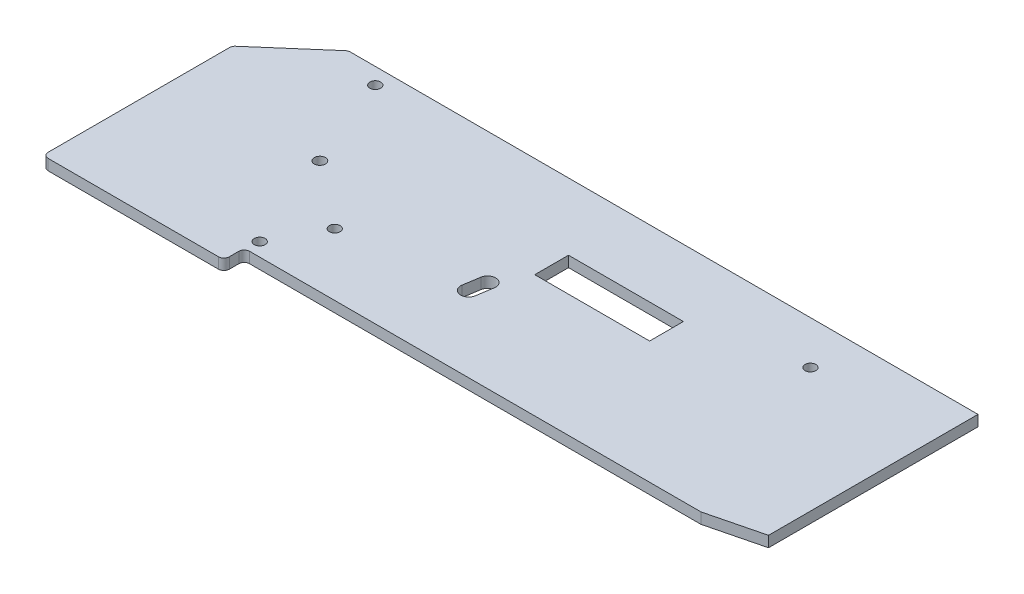
ISO-10303-21;
HEADER;
FILE_DESCRIPTION(('STEP AP214'),'2;1');
FILE_NAME('part.step','',(''),(''),'','','');
FILE_SCHEMA(('AUTOMOTIVE_DESIGN { 1 0 10303 214 1 1 1 1 }'));
ENDSEC;
DATA;
#1=APPLICATION_CONTEXT('core data for automotive mechanical design processes');
#2=APPLICATION_PROTOCOL_DEFINITION('international standard','automotive_design',2000,#1);
#3=PRODUCT_CONTEXT('',#1,'mechanical');
#4=PRODUCT('Part','Part','',(#3));
#5=PRODUCT_RELATED_PRODUCT_CATEGORY('part','',(#4));
#6=PRODUCT_DEFINITION_FORMATION('','',#4);
#7=PRODUCT_DEFINITION_CONTEXT('part definition',#1,'design');
#8=PRODUCT_DEFINITION('design','',#6,#7);
#9=PRODUCT_DEFINITION_SHAPE('','',#8);
#10=(LENGTH_UNIT() NAMED_UNIT(*) SI_UNIT(.MILLI.,.METRE.));
#11=(NAMED_UNIT(*) PLANE_ANGLE_UNIT() SI_UNIT($,.RADIAN.));
#12=(NAMED_UNIT(*) SI_UNIT($,.STERADIAN.) SOLID_ANGLE_UNIT());
#13=UNCERTAINTY_MEASURE_WITH_UNIT(LENGTH_MEASURE(1.E-05),#10,'distance_accuracy_value','');
#14=(GEOMETRIC_REPRESENTATION_CONTEXT(3) GLOBAL_UNCERTAINTY_ASSIGNED_CONTEXT((#13)) GLOBAL_UNIT_ASSIGNED_CONTEXT((#10,
#11,#12)) REPRESENTATION_CONTEXT('',''));
#15=CARTESIAN_POINT('',(0.,0.,0.));
#16=DIRECTION('',(0.,0.,1.));
#17=DIRECTION('',(1.,0.,0.));
#18=AXIS2_PLACEMENT_3D('',#15,#16,#17);
#19=CARTESIAN_POINT('',(0.,0.,0.));
#20=DIRECTION('',(0.,-1.,0.));
#21=DIRECTION('',(0.,0.,-1.));
#22=AXIS2_PLACEMENT_3D('',#19,#20,#21);
#23=PLANE('',#22);
#24=CARTESIAN_POINT('',(30.,0.,40.5));
#25=DIRECTION('',(0.,-1.,0.));
#26=DIRECTION('',(0.,0.,-1.));
#27=AXIS2_PLACEMENT_3D('',#24,#25,#26);
#28=CIRCLE('',#27,2.94102540378449);
#29=CARTESIAN_POINT('',(30.,0.,37.5589745962155));
#30=VERTEX_POINT('',#29);
#31=EDGE_CURVE('E531',#30,#30,#28,.F.);
#32=ORIENTED_EDGE('',*,*,#31,.T.);
#33=EDGE_LOOP('',(#32));
#34=FACE_BOUND('',#33,.T.);
#35=CARTESIAN_POINT('',(44.75,0.,77.5));
#36=DIRECTION('',(0.,-1.,0.));
#37=DIRECTION('',(0.,0.,-1.));
#38=AXIS2_PLACEMENT_3D('',#35,#36,#37);
#39=CIRCLE('',#38,2.86602540378442);
#40=CARTESIAN_POINT('',(44.75,0.,74.6339745962156));
#41=VERTEX_POINT('',#40);
#42=EDGE_CURVE('E528',#41,#41,#39,.F.);
#43=ORIENTED_EDGE('',*,*,#42,.T.);
#44=EDGE_LOOP('',(#43));
#45=FACE_BOUND('',#44,.T.);
#46=DIRECTION('',(0.,0.,1.));
#47=VECTOR('',#46,1.);
#48=CARTESIAN_POINT('',(148.75,0.,0.));
#49=LINE('',#48,#47);
#50=CARTESIAN_POINT('',(148.75,0.,24.75));
#51=VERTEX_POINT('',#50);
#52=CARTESIAN_POINT('',(148.75,0.,37.25));
#53=VERTEX_POINT('',#52);
#54=EDGE_CURVE('E394',#51,#53,#49,.T.);
#55=ORIENTED_EDGE('',*,*,#54,.F.);
#56=DIRECTION('',(1.,0.,0.));
#57=VECTOR('',#56,1.);
#58=CARTESIAN_POINT('',(0.,0.,24.75));
#59=LINE('',#58,#57);
#60=CARTESIAN_POINT('',(106.25,0.,24.75));
#61=VERTEX_POINT('',#60);
#62=EDGE_CURVE('E389',#61,#51,#59,.T.);
#63=ORIENTED_EDGE('',*,*,#62,.F.);
#64=DIRECTION('',(0.,0.,-1.));
#65=VECTOR('',#64,1.);
#66=CARTESIAN_POINT('',(106.25,0.,0.));
#67=LINE('',#66,#65);
#68=CARTESIAN_POINT('',(106.25,0.,37.25));
#69=VERTEX_POINT('',#68);
#70=EDGE_CURVE('E333',#69,#61,#67,.T.);
#71=ORIENTED_EDGE('',*,*,#70,.F.);
#72=DIRECTION('',(-1.,0.,0.));
#73=VECTOR('',#72,1.);
#74=CARTESIAN_POINT('',(0.,0.,37.25));
#75=LINE('',#74,#73);
#76=EDGE_CURVE('E392',#53,#69,#75,.T.);
#77=ORIENTED_EDGE('',*,*,#76,.F.);
#78=EDGE_LOOP('',(#55,#63,#71,#77));
#79=FACE_BOUND('',#78,.T.);
#80=CARTESIAN_POINT('',(100.04462863061,0.,48.5));
#81=DIRECTION('',(0.,-1.,0.));
#82=DIRECTION('',(0.,0.,-1.));
#83=AXIS2_PLACEMENT_3D('',#80,#81,#82);
#84=CIRCLE('',#83,3.);
#85=CARTESIAN_POINT('',(97.0814396539978,0.,48.0314798948958));
#86=VERTEX_POINT('',#85);
#87=CARTESIAN_POINT('',(103.04462863061,0.,48.5));
#88=VERTEX_POINT('',#87);
#89=EDGE_CURVE('E387',#86,#88,#84,.T.);
#90=ORIENTED_EDGE('',*,*,#89,.F.);
#91=DIRECTION('',(0.156173368368066,0.,-0.98772965887057));
#92=VECTOR('',#91,1.);
#93=CARTESIAN_POINT('',(102.122806848904,0.,16.1469918307724));
#94=LINE('',#93,#92);
#95=CARTESIAN_POINT('',(96.1327588061635,0.,54.0314798948958));
#96=VERTEX_POINT('',#95);
#97=EDGE_CURVE('E358',#96,#86,#94,.T.);
#98=ORIENTED_EDGE('',*,*,#97,.F.);
#99=CARTESIAN_POINT('',(99.0959477827752,0.,54.5));
#100=DIRECTION('',(0.,-1.,0.));
#101=DIRECTION('',(0.,0.,-1.));
#102=AXIS2_PLACEMENT_3D('',#99,#100,#101);
#103=CIRCLE('',#102,3.);
#104=CARTESIAN_POINT('',(101.949607056851,0.,55.4255424071771));
#105=VERTEX_POINT('',#104);
#106=EDGE_CURVE('E382',#105,#96,#103,.T.);
#107=ORIENTED_EDGE('',*,*,#106,.F.);
#108=DIRECTION('',(-0.156173368368066,0.,0.98772965887057));
#109=VECTOR('',#108,1.);
#110=CARTESIAN_POINT('',(108.012825462553,0.,17.0782831394652));
#111=LINE('',#110,#109);
#112=EDGE_CURVE('E385',#88,#105,#111,.T.);
#113=ORIENTED_EDGE('',*,*,#112,.F.);
#114=EDGE_LOOP('',(#90,#98,#107,#113));
#115=FACE_BOUND('',#114,.T.);
#116=CARTESIAN_POINT('',(16.,0.,6.));
#117=DIRECTION('',(0.,-1.,0.));
#118=DIRECTION('',(0.,0.,-1.));
#119=AXIS2_PLACEMENT_3D('',#116,#117,#118);
#120=CIRCLE('',#119,5.);
#121=CARTESIAN_POINT('',(16.,0.,0.999999999999999));
#122=VERTEX_POINT('',#121);
#123=EDGE_CURVE('E400',#122,#122,#120,.T.);
#124=ORIENTED_EDGE('',*,*,#123,.F.);
#125=EDGE_LOOP('',(#124));
#126=FACE_BOUND('',#125,.T.);
#127=DIRECTION('',(-0.754605522163505,0.,0.656178714924787));
#128=VECTOR('',#127,1.);
#129=CARTESIAN_POINT('',(0.,0.,0.));
#130=LINE('',#129,#128);
#131=CARTESIAN_POINT('',(-0.564407299023939,0.,0.490788955672991));
#132=VERTEX_POINT('',#131);
#133=CARTESIAN_POINT('',(-22.3123574298496,0.,19.4020499389996));
#134=VERTEX_POINT('',#133);
#135=EDGE_CURVE('E460',#132,#134,#130,.T.);
#136=ORIENTED_EDGE('',*,*,#135,.F.);
#137=CARTESIAN_POINT('',(0.747950130825634,0.,2.));
#138=DIRECTION('',(0.,-1.,0.));
#139=DIRECTION('',(0.,0.,-1.));
#140=AXIS2_PLACEMENT_3D('',#137,#138,#139);
#141=CIRCLE('',#140,2.);
#142=CARTESIAN_POINT('',(0.747950130825634,0.,0.));
#143=VERTEX_POINT('',#142);
#144=EDGE_CURVE('E490',#132,#143,#141,.T.);
#145=ORIENTED_EDGE('',*,*,#144,.T.);
#146=DIRECTION('',(1.,0.,0.));
#147=VECTOR('',#146,1.);
#148=CARTESIAN_POINT('',(0.,0.,0.));
#149=LINE('',#148,#147);
#150=CARTESIAN_POINT('',(233.,0.,0.));
#151=VERTEX_POINT('',#150);
#152=EDGE_CURVE('E463',#143,#151,#149,.T.);
#153=ORIENTED_EDGE('',*,*,#152,.T.);
#154=DIRECTION('',(0.,0.,1.));
#155=VECTOR('',#154,1.);
#156=CARTESIAN_POINT('',(233.,0.,0.));
#157=LINE('',#156,#155);
#158=CARTESIAN_POINT('',(233.,0.,77.5));
#159=VERTEX_POINT('',#158);
#160=EDGE_CURVE('E465',#151,#159,#157,.T.);
#161=ORIENTED_EDGE('',*,*,#160,.T.);
#162=DIRECTION('',(0.970142500145332,0.,-0.242535625036334));
#163=VECTOR('',#162,1.);
#164=CARTESIAN_POINT('',(213.,0.,82.5));
#165=LINE('',#164,#163);
#166=CARTESIAN_POINT('',(213.,0.,82.5));
#167=VERTEX_POINT('',#166);
#168=EDGE_CURVE('E468',#167,#159,#165,.T.);
#169=ORIENTED_EDGE('',*,*,#168,.F.);
#170=DIRECTION('',(-1.,0.,0.));
#171=VECTOR('',#170,1.);
#172=CARTESIAN_POINT('',(213.,0.,82.5));
#173=LINE('',#172,#171);
#174=CARTESIAN_POINT('',(46.,0.,82.5));
#175=VERTEX_POINT('',#174);
#176=EDGE_CURVE('E434',#167,#175,#173,.T.);
#177=ORIENTED_EDGE('',*,*,#176,.T.);
#178=CARTESIAN_POINT('',(46.,0.,84.5));
#179=DIRECTION('',(0.,-1.,0.));
#180=DIRECTION('',(0.,0.,-1.));
#181=AXIS2_PLACEMENT_3D('',#178,#179,#180);
#182=CIRCLE('',#181,2.);
#183=CARTESIAN_POINT('',(44.,0.,84.5));
#184=VERTEX_POINT('',#183);
#185=EDGE_CURVE('E518',#175,#184,#182,.F.);
#186=ORIENTED_EDGE('',*,*,#185,.T.);
#187=DIRECTION('',(0.,0.,1.));
#188=VECTOR('',#187,1.);
#189=CARTESIAN_POINT('',(44.,0.,82.5));
#190=LINE('',#189,#188);
#191=CARTESIAN_POINT('',(44.,0.,88.));
#192=VERTEX_POINT('',#191);
#193=EDGE_CURVE('E429',#184,#192,#190,.T.);
#194=ORIENTED_EDGE('',*,*,#193,.T.);
#195=CARTESIAN_POINT('',(42.,0.,88.));
#196=DIRECTION('',(0.,-1.,0.));
#197=DIRECTION('',(0.,0.,-1.));
#198=AXIS2_PLACEMENT_3D('',#195,#196,#197);
#199=CIRCLE('',#198,2.);
#200=CARTESIAN_POINT('',(42.,0.,90.));
#201=VERTEX_POINT('',#200);
#202=EDGE_CURVE('E484',#192,#201,#199,.T.);
#203=ORIENTED_EDGE('',*,*,#202,.T.);
#204=DIRECTION('',(-1.,0.,0.));
#205=VECTOR('',#204,1.);
#206=CARTESIAN_POINT('',(44.,0.,90.));
#207=LINE('',#206,#205);
#208=CARTESIAN_POINT('',(-21.,0.,90.));
#209=VERTEX_POINT('',#208);
#210=EDGE_CURVE('E454',#201,#209,#207,.T.);
#211=ORIENTED_EDGE('',*,*,#210,.T.);
#212=CARTESIAN_POINT('',(-21.,0.,88.));
#213=DIRECTION('',(0.,-1.,0.));
#214=DIRECTION('',(0.,0.,-1.));
#215=AXIS2_PLACEMENT_3D('',#212,#213,#214);
#216=CIRCLE('',#215,2.);
#217=CARTESIAN_POINT('',(-23.,0.,88.));
#218=VERTEX_POINT('',#217);
#219=EDGE_CURVE('E486',#209,#218,#216,.T.);
#220=ORIENTED_EDGE('',*,*,#219,.T.);
#221=DIRECTION('',(0.,0.,1.));
#222=VECTOR('',#221,1.);
#223=CARTESIAN_POINT('',(-23.,0.,20.));
#224=LINE('',#223,#222);
#225=CARTESIAN_POINT('',(-23.,0.,20.9112609833266));
#226=VERTEX_POINT('',#225);
#227=EDGE_CURVE('E457',#226,#218,#224,.T.);
#228=ORIENTED_EDGE('',*,*,#227,.F.);
#229=CARTESIAN_POINT('',(-21.,0.,20.9112609833266));
#230=DIRECTION('',(0.,-1.,0.));
#231=DIRECTION('',(0.,0.,-1.));
#232=AXIS2_PLACEMENT_3D('',#229,#230,#231);
#233=CIRCLE('',#232,2.);
#234=EDGE_CURVE('E488',#226,#134,#233,.T.);
#235=ORIENTED_EDGE('',*,*,#234,.T.);
#236=EDGE_LOOP('',(#136,#145,#153,#161,#169,#177,#186,#194,#203,#211,#220,#228,#235));
#237=FACE_BOUND('',#236,.T.);
#238=CARTESIAN_POINT('',(187.,0.,16.));
#239=DIRECTION('',(0.,-1.,0.));
#240=DIRECTION('',(0.,0.,-1.));
#241=AXIS2_PLACEMENT_3D('',#238,#239,#240);
#242=CIRCLE('',#241,7.50000000000001);
#243=CARTESIAN_POINT('',(187.,0.,8.49999999999999));
#244=VERTEX_POINT('',#243);
#245=EDGE_CURVE('E406',#244,#244,#242,.T.);
#246=ORIENTED_EDGE('',*,*,#245,.F.);
#247=EDGE_LOOP('',(#246));
#248=FACE_BOUND('',#247,.T.);
#249=CARTESIAN_POINT('',(54.5,0.,59.5));
#250=DIRECTION('',(0.,-1.,0.));
#251=DIRECTION('',(0.,0.,-1.));
#252=AXIS2_PLACEMENT_3D('',#249,#250,#251);
#253=CIRCLE('',#252,8.75);
#254=CARTESIAN_POINT('',(54.5,0.,50.75));
#255=VERTEX_POINT('',#254);
#256=EDGE_CURVE('E397',#255,#255,#253,.T.);
#257=ORIENTED_EDGE('',*,*,#256,.F.);
#258=EDGE_LOOP('',(#257));
#259=FACE_BOUND('',#258,.T.);
#260=ADVANCED_FACE('F180',(#34,#45,#79,#115,#126,#237,#248,#259),#23,.T.);
#261=CARTESIAN_POINT('',(0.,4.,0.));
#262=DIRECTION('',(0.,-1.,0.));
#263=DIRECTION('',(0.,0.,-1.));
#264=AXIS2_PLACEMENT_3D('',#261,#262,#263);
#265=PLANE('',#264);
#266=DIRECTION('',(-1.,0.,0.));
#267=VECTOR('',#266,1.);
#268=CARTESIAN_POINT('',(106.25,4.,24.75));
#269=LINE('',#268,#267);
#270=CARTESIAN_POINT('',(148.75,4.,24.75));
#271=VERTEX_POINT('',#270);
#272=CARTESIAN_POINT('',(106.25,4.,24.75));
#273=VERTEX_POINT('',#272);
#274=EDGE_CURVE('E341',#271,#273,#269,.T.);
#275=ORIENTED_EDGE('',*,*,#274,.F.);
#276=DIRECTION('',(0.,0.,-1.));
#277=VECTOR('',#276,1.);
#278=CARTESIAN_POINT('',(148.75,4.,37.25));
#279=LINE('',#278,#277);
#280=CARTESIAN_POINT('',(148.75,4.,37.25));
#281=VERTEX_POINT('',#280);
#282=EDGE_CURVE('E346',#281,#271,#279,.T.);
#283=ORIENTED_EDGE('',*,*,#282,.F.);
#284=DIRECTION('',(1.,0.,0.));
#285=VECTOR('',#284,1.);
#286=CARTESIAN_POINT('',(106.25,4.,37.25));
#287=LINE('',#286,#285);
#288=CARTESIAN_POINT('',(106.25,4.,37.25));
#289=VERTEX_POINT('',#288);
#290=EDGE_CURVE('E351',#289,#281,#287,.T.);
#291=ORIENTED_EDGE('',*,*,#290,.F.);
#292=DIRECTION('',(0.,0.,1.));
#293=VECTOR('',#292,1.);
#294=CARTESIAN_POINT('',(106.25,4.,37.25));
#295=LINE('',#294,#293);
#296=EDGE_CURVE('E330',#273,#289,#295,.T.);
#297=ORIENTED_EDGE('',*,*,#296,.F.);
#298=EDGE_LOOP('',(#275,#283,#291,#297));
#299=FACE_BOUND('',#298,.T.);
#300=DIRECTION('',(-0.156173368368066,0.,0.98772965887057));
#301=VECTOR('',#300,1.);
#302=CARTESIAN_POINT('',(97.0814396539978,4.,48.0314798948958));
#303=LINE('',#302,#301);
#304=CARTESIAN_POINT('',(97.0814396539978,4.,48.0314798948958));
#305=VERTEX_POINT('',#304);
#306=CARTESIAN_POINT('',(96.1327588061635,4.,54.0314798948958));
#307=VERTEX_POINT('',#306);
#308=EDGE_CURVE('E363',#305,#307,#303,.T.);
#309=ORIENTED_EDGE('',*,*,#308,.F.);
#310=CARTESIAN_POINT('',(100.04462863061,4.,48.5));
#311=DIRECTION('',(0.,1.,0.));
#312=DIRECTION('',(0.,0.,1.));
#313=AXIS2_PLACEMENT_3D('',#310,#311,#312);
#314=CIRCLE('',#313,3.);
#315=CARTESIAN_POINT('',(103.04462863061,4.,48.5));
#316=VERTEX_POINT('',#315);
#317=EDGE_CURVE('E361',#316,#305,#314,.T.);
#318=ORIENTED_EDGE('',*,*,#317,.F.);
#319=DIRECTION('',(0.156173368368066,0.,-0.98772965887057));
#320=VECTOR('',#319,1.);
#321=CARTESIAN_POINT('',(101.949607056851,4.,55.4255424071771));
#322=LINE('',#321,#320);
#323=CARTESIAN_POINT('',(101.949607056851,4.,55.4255424071771));
#324=VERTEX_POINT('',#323);
#325=EDGE_CURVE('E369',#324,#316,#322,.T.);
#326=ORIENTED_EDGE('',*,*,#325,.F.);
#327=CARTESIAN_POINT('',(99.0959477827752,4.,54.5));
#328=DIRECTION('',(0.,1.,0.));
#329=DIRECTION('',(0.,0.,1.));
#330=AXIS2_PLACEMENT_3D('',#327,#328,#329);
#331=CIRCLE('',#330,3.);
#332=EDGE_CURVE('E366',#307,#324,#331,.T.);
#333=ORIENTED_EDGE('',*,*,#332,.F.);
#334=EDGE_LOOP('',(#309,#318,#326,#333));
#335=FACE_BOUND('',#334,.T.);
#336=DIRECTION('',(1.,0.,0.));
#337=VECTOR('',#336,1.);
#338=CARTESIAN_POINT('',(0.,4.,0.));
#339=LINE('',#338,#337);
#340=CARTESIAN_POINT('',(0.747950130825634,4.,0.));
#341=VERTEX_POINT('',#340);
#342=CARTESIAN_POINT('',(233.,4.,0.));
#343=VERTEX_POINT('',#342);
#344=EDGE_CURVE('E441',#341,#343,#339,.T.);
#345=ORIENTED_EDGE('',*,*,#344,.F.);
#346=CARTESIAN_POINT('',(0.747950130825634,4.,2.));
#347=DIRECTION('',(0.,-1.,0.));
#348=DIRECTION('',(0.,0.,-1.));
#349=AXIS2_PLACEMENT_3D('',#346,#347,#348);
#350=CIRCLE('',#349,2.);
#351=CARTESIAN_POINT('',(-0.564407299023939,4.,0.490788955672991));
#352=VERTEX_POINT('',#351);
#353=EDGE_CURVE('E499',#341,#352,#350,.F.);
#354=ORIENTED_EDGE('',*,*,#353,.T.);
#355=DIRECTION('',(-0.754605522163505,0.,0.656178714924787));
#356=VECTOR('',#355,1.);
#357=CARTESIAN_POINT('',(0.,4.,0.));
#358=LINE('',#357,#356);
#359=CARTESIAN_POINT('',(-22.3123574298496,4.,19.4020499389996));
#360=VERTEX_POINT('',#359);
#361=EDGE_CURVE('E438',#352,#360,#358,.T.);
#362=ORIENTED_EDGE('',*,*,#361,.T.);
#363=CARTESIAN_POINT('',(-21.,4.,20.9112609833266));
#364=DIRECTION('',(0.,-1.,0.));
#365=DIRECTION('',(0.,0.,-1.));
#366=AXIS2_PLACEMENT_3D('',#363,#364,#365);
#367=CIRCLE('',#366,2.);
#368=CARTESIAN_POINT('',(-23.,4.,20.9112609833266));
#369=VERTEX_POINT('',#368);
#370=EDGE_CURVE('E497',#360,#369,#367,.F.);
#371=ORIENTED_EDGE('',*,*,#370,.T.);
#372=DIRECTION('',(0.,0.,1.));
#373=VECTOR('',#372,1.);
#374=CARTESIAN_POINT('',(-23.,4.,20.));
#375=LINE('',#374,#373);
#376=CARTESIAN_POINT('',(-23.,4.,88.));
#377=VERTEX_POINT('',#376);
#378=EDGE_CURVE('E436',#369,#377,#375,.T.);
#379=ORIENTED_EDGE('',*,*,#378,.T.);
#380=CARTESIAN_POINT('',(-21.,4.,88.));
#381=DIRECTION('',(0.,-1.,0.));
#382=DIRECTION('',(0.,0.,-1.));
#383=AXIS2_PLACEMENT_3D('',#380,#381,#382);
#384=CIRCLE('',#383,2.);
#385=CARTESIAN_POINT('',(-21.,4.,90.));
#386=VERTEX_POINT('',#385);
#387=EDGE_CURVE('E195',#377,#386,#384,.F.);
#388=ORIENTED_EDGE('',*,*,#387,.T.);
#389=DIRECTION('',(-1.,0.,0.));
#390=VECTOR('',#389,1.);
#391=CARTESIAN_POINT('',(44.,4.,90.));
#392=LINE('',#391,#390);
#393=CARTESIAN_POINT('',(42.,4.,90.));
#394=VERTEX_POINT('',#393);
#395=EDGE_CURVE('E433',#394,#386,#392,.T.);
#396=ORIENTED_EDGE('',*,*,#395,.F.);
#397=CARTESIAN_POINT('',(42.,4.,88.));
#398=DIRECTION('',(0.,-1.,0.));
#399=DIRECTION('',(0.,0.,-1.));
#400=AXIS2_PLACEMENT_3D('',#397,#398,#399);
#401=CIRCLE('',#400,2.);
#402=CARTESIAN_POINT('',(44.,4.,88.));
#403=VERTEX_POINT('',#402);
#404=EDGE_CURVE('E494',#394,#403,#401,.F.);
#405=ORIENTED_EDGE('',*,*,#404,.T.);
#406=DIRECTION('',(0.,0.,1.));
#407=VECTOR('',#406,1.);
#408=CARTESIAN_POINT('',(44.,4.,82.5));
#409=LINE('',#408,#407);
#410=CARTESIAN_POINT('',(44.,4.,84.5));
#411=VERTEX_POINT('',#410);
#412=EDGE_CURVE('E430',#411,#403,#409,.T.);
#413=ORIENTED_EDGE('',*,*,#412,.F.);
#414=CARTESIAN_POINT('',(46.,4.,84.5));
#415=DIRECTION('',(0.,-1.,0.));
#416=DIRECTION('',(0.,0.,-1.));
#417=AXIS2_PLACEMENT_3D('',#414,#415,#416);
#418=CIRCLE('',#417,2.);
#419=CARTESIAN_POINT('',(46.,4.,82.5));
#420=VERTEX_POINT('',#419);
#421=EDGE_CURVE('E520',#411,#420,#418,.T.);
#422=ORIENTED_EDGE('',*,*,#421,.T.);
#423=DIRECTION('',(-1.,0.,0.));
#424=VECTOR('',#423,1.);
#425=CARTESIAN_POINT('',(213.,4.,82.5));
#426=LINE('',#425,#424);
#427=CARTESIAN_POINT('',(213.,4.,82.5));
#428=VERTEX_POINT('',#427);
#429=EDGE_CURVE('E448',#428,#420,#426,.T.);
#430=ORIENTED_EDGE('',*,*,#429,.F.);
#431=DIRECTION('',(0.970142500145332,0.,-0.242535625036334));
#432=VECTOR('',#431,1.);
#433=CARTESIAN_POINT('',(213.,4.,82.5));
#434=LINE('',#433,#432);
#435=CARTESIAN_POINT('',(233.,4.,77.5));
#436=VERTEX_POINT('',#435);
#437=EDGE_CURVE('E446',#428,#436,#434,.T.);
#438=ORIENTED_EDGE('',*,*,#437,.T.);
#439=DIRECTION('',(0.,0.,1.));
#440=VECTOR('',#439,1.);
#441=CARTESIAN_POINT('',(233.,4.,0.));
#442=LINE('',#441,#440);
#443=EDGE_CURVE('E443',#343,#436,#442,.T.);
#444=ORIENTED_EDGE('',*,*,#443,.F.);
#445=EDGE_LOOP('',(#345,#354,#362,#371,#379,#388,#396,#405,#413,#422,#430,#438,#444));
#446=FACE_BOUND('',#445,.T.);
#447=CARTESIAN_POINT('',(16.,4.,6.));
#448=DIRECTION('',(0.,1.,0.));
#449=DIRECTION('',(0.,0.,1.));
#450=AXIS2_PLACEMENT_3D('',#447,#448,#449);
#451=CIRCLE('',#450,2.);
#452=CARTESIAN_POINT('',(16.,4.,8.));
#453=VERTEX_POINT('',#452);
#454=EDGE_CURVE('E426',#453,#453,#451,.T.);
#455=ORIENTED_EDGE('',*,*,#454,.F.);
#456=EDGE_LOOP('',(#455));
#457=FACE_BOUND('',#456,.T.);
#458=CARTESIAN_POINT('',(30.,4.,40.5));
#459=DIRECTION('',(0.,1.,0.));
#460=DIRECTION('',(0.,0.,1.));
#461=AXIS2_PLACEMENT_3D('',#458,#459,#460);
#462=CIRCLE('',#461,2.075);
#463=CARTESIAN_POINT('',(30.,4.,42.575));
#464=VERTEX_POINT('',#463);
#465=EDGE_CURVE('E423',#464,#464,#462,.T.);
#466=ORIENTED_EDGE('',*,*,#465,.F.);
#467=EDGE_LOOP('',(#466));
#468=FACE_BOUND('',#467,.T.);
#469=CARTESIAN_POINT('',(54.5,4.,59.5));
#470=DIRECTION('',(0.,1.,0.));
#471=DIRECTION('',(0.,0.,1.));
#472=AXIS2_PLACEMENT_3D('',#469,#470,#471);
#473=CIRCLE('',#472,2.);
#474=CARTESIAN_POINT('',(54.5,4.,61.5));
#475=VERTEX_POINT('',#474);
#476=EDGE_CURVE('E420',#475,#475,#473,.T.);
#477=ORIENTED_EDGE('',*,*,#476,.F.);
#478=EDGE_LOOP('',(#477));
#479=FACE_BOUND('',#478,.T.);
#480=CARTESIAN_POINT('',(44.75,4.,77.5));
#481=DIRECTION('',(0.,1.,0.));
#482=DIRECTION('',(0.,0.,1.));
#483=AXIS2_PLACEMENT_3D('',#480,#481,#482);
#484=CIRCLE('',#483,2.);
#485=CARTESIAN_POINT('',(44.75,4.,79.5));
#486=VERTEX_POINT('',#485);
#487=EDGE_CURVE('E417',#486,#486,#484,.T.);
#488=ORIENTED_EDGE('',*,*,#487,.F.);
#489=EDGE_LOOP('',(#488));
#490=FACE_BOUND('',#489,.T.);
#491=CARTESIAN_POINT('',(187.,4.,16.));
#492=DIRECTION('',(0.,1.,0.));
#493=DIRECTION('',(0.,0.,1.));
#494=AXIS2_PLACEMENT_3D('',#491,#492,#493);
#495=CIRCLE('',#494,2.);
#496=CARTESIAN_POINT('',(187.,4.,18.));
#497=VERTEX_POINT('',#496);
#498=EDGE_CURVE('E412',#497,#497,#495,.T.);
#499=ORIENTED_EDGE('',*,*,#498,.F.);
#500=EDGE_LOOP('',(#499));
#501=FACE_BOUND('',#500,.T.);
#502=ADVANCED_FACE('F348',(#299,#335,#446,#457,#468,#479,#490,#501),#265,.F.);
#503=CARTESIAN_POINT('',(44.,4.,82.5));
#504=DIRECTION('',(1.,0.,0.));
#505=DIRECTION('',(0.,0.,-1.));
#506=AXIS2_PLACEMENT_3D('',#503,#504,#505);
#507=PLANE('',#506);
#508=ORIENTED_EDGE('',*,*,#412,.T.);
#509=DIRECTION('',(0.,-1.,0.));
#510=VECTOR('',#509,1.);
#511=CARTESIAN_POINT('',(44.,4.,88.));
#512=LINE('',#511,#510);
#513=EDGE_CURVE('E512',#403,#192,#512,.T.);
#514=ORIENTED_EDGE('',*,*,#513,.T.);
#515=ORIENTED_EDGE('',*,*,#193,.F.);
#516=DIRECTION('',(0.,-1.,0.));
#517=VECTOR('',#516,1.);
#518=CARTESIAN_POINT('',(44.,4.,84.5));
#519=LINE('',#518,#517);
#520=EDGE_CURVE('E510',#184,#411,#519,.F.);
#521=ORIENTED_EDGE('',*,*,#520,.T.);
#522=EDGE_LOOP('',(#508,#514,#515,#521));
#523=FACE_BOUND('',#522,.T.);
#524=ADVANCED_FACE('F566',(#523),#507,.T.);
#525=CARTESIAN_POINT('',(213.,4.,82.5));
#526=DIRECTION('',(0.,0.,1.));
#527=DIRECTION('',(1.,0.,0.));
#528=AXIS2_PLACEMENT_3D('',#525,#526,#527);
#529=PLANE('',#528);
#530=ORIENTED_EDGE('',*,*,#429,.T.);
#531=DIRECTION('',(0.,-1.,0.));
#532=VECTOR('',#531,1.);
#533=CARTESIAN_POINT('',(46.,0.,82.5));
#534=LINE('',#533,#532);
#535=EDGE_CURVE('E515',#420,#175,#534,.T.);
#536=ORIENTED_EDGE('',*,*,#535,.T.);
#537=ORIENTED_EDGE('',*,*,#176,.F.);
#538=DIRECTION('',(0.,-1.,0.));
#539=VECTOR('',#538,1.);
#540=CARTESIAN_POINT('',(213.,4.,82.5));
#541=LINE('',#540,#539);
#542=EDGE_CURVE('E473',#428,#167,#541,.T.);
#543=ORIENTED_EDGE('',*,*,#542,.F.);
#544=EDGE_LOOP('',(#530,#536,#537,#543));
#545=FACE_BOUND('',#544,.T.);
#546=ADVANCED_FACE('F571',(#545),#529,.T.);
#547=CARTESIAN_POINT('',(213.,4.,82.5));
#548=DIRECTION('',(-0.242535625036334,0.,-0.970142500145332));
#549=DIRECTION('',(-0.970142500145332,0.,0.242535625036334));
#550=AXIS2_PLACEMENT_3D('',#547,#548,#549);
#551=PLANE('',#550);
#552=ORIENTED_EDGE('',*,*,#168,.T.);
#553=DIRECTION('',(0.,-1.,0.));
#554=VECTOR('',#553,1.);
#555=CARTESIAN_POINT('',(233.,4.,77.5));
#556=LINE('',#555,#554);
#557=EDGE_CURVE('E476',#436,#159,#556,.T.);
#558=ORIENTED_EDGE('',*,*,#557,.F.);
#559=ORIENTED_EDGE('',*,*,#437,.F.);
#560=ORIENTED_EDGE('',*,*,#542,.T.);
#561=EDGE_LOOP('',(#552,#558,#559,#560));
#562=FACE_BOUND('',#561,.T.);
#563=ADVANCED_FACE('F574',(#562),#551,.F.);
#564=CARTESIAN_POINT('',(233.,4.,0.));
#565=DIRECTION('',(1.,0.,0.));
#566=DIRECTION('',(0.,0.,-1.));
#567=AXIS2_PLACEMENT_3D('',#564,#565,#566);
#568=PLANE('',#567);
#569=ORIENTED_EDGE('',*,*,#160,.F.);
#570=DIRECTION('',(0.,-1.,0.));
#571=VECTOR('',#570,1.);
#572=CARTESIAN_POINT('',(233.,4.,0.));
#573=LINE('',#572,#571);
#574=EDGE_CURVE('E451',#343,#151,#573,.T.);
#575=ORIENTED_EDGE('',*,*,#574,.F.);
#576=ORIENTED_EDGE('',*,*,#443,.T.);
#577=ORIENTED_EDGE('',*,*,#557,.T.);
#578=EDGE_LOOP('',(#569,#575,#576,#577));
#579=FACE_BOUND('',#578,.T.);
#580=ADVANCED_FACE('F578',(#579),#568,.T.);
#581=CARTESIAN_POINT('',(0.,4.,0.));
#582=DIRECTION('',(0.,0.,-1.));
#583=DIRECTION('',(-1.,0.,0.));
#584=AXIS2_PLACEMENT_3D('',#581,#582,#583);
#585=PLANE('',#584);
#586=ORIENTED_EDGE('',*,*,#152,.F.);
#587=DIRECTION('',(0.,-1.,0.));
#588=VECTOR('',#587,1.);
#589=CARTESIAN_POINT('',(0.747950130825634,4.,0.));
#590=LINE('',#589,#588);
#591=EDGE_CURVE('E492',#143,#341,#590,.F.);
#592=ORIENTED_EDGE('',*,*,#591,.T.);
#593=ORIENTED_EDGE('',*,*,#344,.T.);
#594=ORIENTED_EDGE('',*,*,#574,.T.);
#595=EDGE_LOOP('',(#586,#592,#593,#594));
#596=FACE_BOUND('',#595,.T.);
#597=ADVANCED_FACE('F582',(#596),#585,.T.);
#598=CARTESIAN_POINT('',(0.,4.,0.));
#599=DIRECTION('',(0.656178714924787,0.,0.754605522163505));
#600=DIRECTION('',(0.754605522163505,0.,-0.656178714924787));
#601=AXIS2_PLACEMENT_3D('',#598,#599,#600);
#602=PLANE('',#601);
#603=ORIENTED_EDGE('',*,*,#361,.F.);
#604=DIRECTION('',(0.,-1.,0.));
#605=VECTOR('',#604,1.);
#606=CARTESIAN_POINT('',(-0.564407299023939,0.,0.490788955672991));
#607=LINE('',#606,#605);
#608=EDGE_CURVE('E481',#352,#132,#607,.T.);
#609=ORIENTED_EDGE('',*,*,#608,.T.);
#610=ORIENTED_EDGE('',*,*,#135,.T.);
#611=DIRECTION('',(0.,-1.,0.));
#612=VECTOR('',#611,1.);
#613=CARTESIAN_POINT('',(-22.3123574298496,4.,19.4020499389996));
#614=LINE('',#613,#612);
#615=EDGE_CURVE('E475',#134,#360,#614,.F.);
#616=ORIENTED_EDGE('',*,*,#615,.T.);
#617=EDGE_LOOP('',(#603,#609,#610,#616));
#618=FACE_BOUND('',#617,.T.);
#619=ADVANCED_FACE('F586',(#618),#602,.F.);
#620=CARTESIAN_POINT('',(-23.,4.,20.));
#621=DIRECTION('',(1.,0.,0.));
#622=DIRECTION('',(0.,0.,-1.));
#623=AXIS2_PLACEMENT_3D('',#620,#621,#622);
#624=PLANE('',#623);
#625=ORIENTED_EDGE('',*,*,#378,.F.);
#626=DIRECTION('',(0.,-1.,0.));
#627=VECTOR('',#626,1.);
#628=CARTESIAN_POINT('',(-23.,4.,20.9112609833266));
#629=LINE('',#628,#627);
#630=EDGE_CURVE('E503',#369,#226,#629,.T.);
#631=ORIENTED_EDGE('',*,*,#630,.T.);
#632=ORIENTED_EDGE('',*,*,#227,.T.);
#633=DIRECTION('',(0.,-1.,0.));
#634=VECTOR('',#633,1.);
#635=CARTESIAN_POINT('',(-23.,4.,88.));
#636=LINE('',#635,#634);
#637=EDGE_CURVE('E501',#218,#377,#636,.F.);
#638=ORIENTED_EDGE('',*,*,#637,.T.);
#639=EDGE_LOOP('',(#625,#631,#632,#638));
#640=FACE_BOUND('',#639,.T.);
#641=ADVANCED_FACE('F590',(#640),#624,.F.);
#642=CARTESIAN_POINT('',(44.,4.,90.));
#643=DIRECTION('',(0.,0.,1.));
#644=DIRECTION('',(1.,0.,0.));
#645=AXIS2_PLACEMENT_3D('',#642,#643,#644);
#646=PLANE('',#645);
#647=ORIENTED_EDGE('',*,*,#395,.T.);
#648=DIRECTION('',(0.,-1.,0.));
#649=VECTOR('',#648,1.);
#650=CARTESIAN_POINT('',(-21.,0.,90.));
#651=LINE('',#650,#649);
#652=EDGE_CURVE('E507',#386,#209,#651,.T.);
#653=ORIENTED_EDGE('',*,*,#652,.T.);
#654=ORIENTED_EDGE('',*,*,#210,.F.);
#655=DIRECTION('',(0.,-1.,0.));
#656=VECTOR('',#655,1.);
#657=CARTESIAN_POINT('',(42.,4.,90.));
#658=LINE('',#657,#656);
#659=EDGE_CURVE('E202',#201,#394,#658,.F.);
#660=ORIENTED_EDGE('',*,*,#659,.T.);
#661=EDGE_LOOP('',(#647,#653,#654,#660));
#662=FACE_BOUND('',#661,.T.);
#663=ADVANCED_FACE('F594',(#662),#646,.T.);
#664=CARTESIAN_POINT('',(16.,4.,6.));
#665=DIRECTION('',(0.,-1.,0.));
#666=DIRECTION('',(0.,0.,-1.));
#667=AXIS2_PLACEMENT_3D('',#664,#665,#666);
#668=CYLINDRICAL_SURFACE('',#667,2.);
#669=CARTESIAN_POINT('',(16.,-0.883974596215559,6.));
#670=DIRECTION('',(0.,-1.,0.));
#671=DIRECTION('',(0.,0.,-1.));
#672=AXIS2_PLACEMENT_3D('',#669,#670,#671);
#673=CIRCLE('',#672,2.);
#674=CARTESIAN_POINT('',(16.,-0.883974596215559,4.));
#675=VERTEX_POINT('',#674);
#676=EDGE_CURVE('E522',#675,#675,#673,.T.);
#677=ORIENTED_EDGE('',*,*,#676,.T.);
#678=EDGE_LOOP('',(#677));
#679=FACE_BOUND('',#678,.T.);
#680=ORIENTED_EDGE('',*,*,#454,.T.);
#681=EDGE_LOOP('',(#680));
#682=FACE_BOUND('',#681,.T.);
#683=ADVANCED_FACE('F598',(#679,#682),#668,.F.);
#684=CARTESIAN_POINT('',(30.,4.,40.5));
#685=DIRECTION('',(0.,-1.,0.));
#686=DIRECTION('',(0.,0.,-1.));
#687=AXIS2_PLACEMENT_3D('',#684,#685,#686);
#688=CYLINDRICAL_SURFACE('',#687,2.075);
#689=CARTESIAN_POINT('',(30.,0.500000000000002,40.5));
#690=DIRECTION('',(0.,-1.,0.));
#691=DIRECTION('',(0.,0.,-1.));
#692=AXIS2_PLACEMENT_3D('',#689,#690,#691);
#693=CIRCLE('',#692,2.075);
#694=CARTESIAN_POINT('',(30.,0.500000000000002,38.425));
#695=VERTEX_POINT('',#694);
#696=EDGE_CURVE('E534',#695,#695,#693,.T.);
#697=ORIENTED_EDGE('',*,*,#696,.T.);
#698=EDGE_LOOP('',(#697));
#699=FACE_BOUND('',#698,.T.);
#700=ORIENTED_EDGE('',*,*,#465,.T.);
#701=EDGE_LOOP('',(#700));
#702=FACE_BOUND('',#701,.T.);
#703=ADVANCED_FACE('F696',(#699,#702),#688,.F.);
#704=CARTESIAN_POINT('',(54.5,4.,59.5));
#705=DIRECTION('',(0.,-1.,0.));
#706=DIRECTION('',(0.,0.,-1.));
#707=AXIS2_PLACEMENT_3D('',#704,#705,#706);
#708=CYLINDRICAL_SURFACE('',#707,2.);
#709=CARTESIAN_POINT('',(54.5,-0.883974596215565,59.5));
#710=DIRECTION('',(0.,-1.,0.));
#711=DIRECTION('',(0.,0.,-1.));
#712=AXIS2_PLACEMENT_3D('',#709,#710,#711);
#713=CIRCLE('',#712,2.);
#714=CARTESIAN_POINT('',(54.5,-0.883974596215565,57.5));
#715=VERTEX_POINT('',#714);
#716=EDGE_CURVE('E540',#715,#715,#713,.T.);
#717=ORIENTED_EDGE('',*,*,#716,.T.);
#718=EDGE_LOOP('',(#717));
#719=FACE_BOUND('',#718,.T.);
#720=ORIENTED_EDGE('',*,*,#476,.T.);
#721=EDGE_LOOP('',(#720));
#722=FACE_BOUND('',#721,.T.);
#723=ADVANCED_FACE('F692',(#719,#722),#708,.F.);
#724=CARTESIAN_POINT('',(44.75,4.,77.5));
#725=DIRECTION('',(0.,-1.,0.));
#726=DIRECTION('',(0.,0.,-1.));
#727=AXIS2_PLACEMENT_3D('',#724,#725,#726);
#728=CYLINDRICAL_SURFACE('',#727,2.);
#729=CARTESIAN_POINT('',(44.75,0.499999999999964,77.5));
#730=DIRECTION('',(0.,-1.,0.));
#731=DIRECTION('',(0.,0.,-1.));
#732=AXIS2_PLACEMENT_3D('',#729,#730,#731);
#733=CIRCLE('',#732,2.);
#734=CARTESIAN_POINT('',(44.75,0.499999999999964,75.5));
#735=VERTEX_POINT('',#734);
#736=EDGE_CURVE('E537',#735,#735,#733,.T.);
#737=ORIENTED_EDGE('',*,*,#736,.T.);
#738=EDGE_LOOP('',(#737));
#739=FACE_BOUND('',#738,.T.);
#740=ORIENTED_EDGE('',*,*,#487,.T.);
#741=EDGE_LOOP('',(#740));
#742=FACE_BOUND('',#741,.T.);
#743=ADVANCED_FACE('F689',(#739,#742),#728,.F.);
#744=CARTESIAN_POINT('',(187.,4.,16.));
#745=DIRECTION('',(0.,-1.,0.));
#746=DIRECTION('',(0.,0.,-1.));
#747=AXIS2_PLACEMENT_3D('',#744,#745,#746);
#748=CYLINDRICAL_SURFACE('',#747,2.);
#749=CARTESIAN_POINT('',(187.,-5.13397459621555,16.));
#750=DIRECTION('',(0.,-1.,0.));
#751=DIRECTION('',(0.,0.,-1.));
#752=AXIS2_PLACEMENT_3D('',#749,#750,#751);
#753=CIRCLE('',#752,2.);
#754=CARTESIAN_POINT('',(187.,-5.13397459621555,14.));
#755=VERTEX_POINT('',#754);
#756=EDGE_CURVE('E188',#755,#755,#753,.T.);
#757=ORIENTED_EDGE('',*,*,#756,.T.);
#758=EDGE_LOOP('',(#757));
#759=FACE_BOUND('',#758,.T.);
#760=ORIENTED_EDGE('',*,*,#498,.T.);
#761=EDGE_LOOP('',(#760));
#762=FACE_BOUND('',#761,.T.);
#763=ADVANCED_FACE('F548',(#759,#762),#748,.F.);
#764=CARTESIAN_POINT('',(187.,-6.,16.));
#765=DIRECTION('',(0.,-1.,0.));
#766=DIRECTION('',(0.,0.,-1.));
#767=AXIS2_PLACEMENT_3D('',#764,#765,#766);
#768=PLANE('',#767);
#769=CARTESIAN_POINT('',(187.,-6.,16.));
#770=DIRECTION('',(0.,-1.,0.));
#771=DIRECTION('',(0.,0.,-1.));
#772=AXIS2_PLACEMENT_3D('',#769,#770,#771);
#773=CIRCLE('',#772,2.5);
#774=CARTESIAN_POINT('',(187.,-6.,13.5));
#775=VERTEX_POINT('',#774);
#776=EDGE_CURVE('E12',#775,#775,#773,.F.);
#777=ORIENTED_EDGE('',*,*,#776,.T.);
#778=EDGE_LOOP('',(#777));
#779=FACE_BOUND('',#778,.T.);
#780=CARTESIAN_POINT('',(187.,-6.,16.));
#781=DIRECTION('',(0.,-1.,0.));
#782=DIRECTION('',(0.,0.,-1.));
#783=AXIS2_PLACEMENT_3D('',#780,#781,#782);
#784=CIRCLE('',#783,7.50000000000001);
#785=CARTESIAN_POINT('',(187.,-6.,8.49999999999999));
#786=VERTEX_POINT('',#785);
#787=EDGE_CURVE('E409',#786,#786,#784,.T.);
#788=ORIENTED_EDGE('',*,*,#787,.T.);
#789=EDGE_LOOP('',(#788));
#790=FACE_BOUND('',#789,.T.);
#791=ADVANCED_FACE('F680',(#779,#790),#768,.T.);
#792=CARTESIAN_POINT('',(187.,-6.,16.));
#793=DIRECTION('',(0.,1.,0.));
#794=DIRECTION('',(0.,0.,1.));
#795=AXIS2_PLACEMENT_3D('',#792,#793,#794);
#796=CYLINDRICAL_SURFACE('',#795,7.50000000000001);
#797=ORIENTED_EDGE('',*,*,#787,.F.);
#798=EDGE_LOOP('',(#797));
#799=FACE_BOUND('',#798,.T.);
#800=ORIENTED_EDGE('',*,*,#245,.T.);
#801=EDGE_LOOP('',(#800));
#802=FACE_BOUND('',#801,.T.);
#803=ADVANCED_FACE('F675',(#799,#802),#796,.T.);
#804=CARTESIAN_POINT('',(16.,-1.75,6.));
#805=DIRECTION('',(0.,-1.,0.));
#806=DIRECTION('',(0.,0.,-1.));
#807=AXIS2_PLACEMENT_3D('',#804,#805,#806);
#808=PLANE('',#807);
#809=CARTESIAN_POINT('',(16.,-1.75,6.));
#810=DIRECTION('',(0.,-1.,0.));
#811=DIRECTION('',(0.,0.,-1.));
#812=AXIS2_PLACEMENT_3D('',#809,#810,#811);
#813=CIRCLE('',#812,2.5);
#814=CARTESIAN_POINT('',(16.,-1.75,3.5));
#815=VERTEX_POINT('',#814);
#816=EDGE_CURVE('E525',#815,#815,#813,.F.);
#817=ORIENTED_EDGE('',*,*,#816,.T.);
#818=EDGE_LOOP('',(#817));
#819=FACE_BOUND('',#818,.T.);
#820=CARTESIAN_POINT('',(16.,-1.75,6.));
#821=DIRECTION('',(0.,-1.,0.));
#822=DIRECTION('',(0.,0.,-1.));
#823=AXIS2_PLACEMENT_3D('',#820,#821,#822);
#824=CIRCLE('',#823,5.);
#825=CARTESIAN_POINT('',(16.,-1.75,0.999999999999999));
#826=VERTEX_POINT('',#825);
#827=EDGE_CURVE('E403',#826,#826,#824,.T.);
#828=ORIENTED_EDGE('',*,*,#827,.T.);
#829=EDGE_LOOP('',(#828));
#830=FACE_BOUND('',#829,.T.);
#831=ADVANCED_FACE('F672',(#819,#830),#808,.T.);
#832=CARTESIAN_POINT('',(16.,-1.75,6.));
#833=DIRECTION('',(0.,1.,0.));
#834=DIRECTION('',(0.,0.,1.));
#835=AXIS2_PLACEMENT_3D('',#832,#833,#834);
#836=CYLINDRICAL_SURFACE('',#835,5.);
#837=ORIENTED_EDGE('',*,*,#827,.F.);
#838=EDGE_LOOP('',(#837));
#839=FACE_BOUND('',#838,.T.);
#840=ORIENTED_EDGE('',*,*,#123,.T.);
#841=EDGE_LOOP('',(#840));
#842=FACE_BOUND('',#841,.T.);
#843=ADVANCED_FACE('F666',(#839,#842),#836,.T.);
#844=CARTESIAN_POINT('',(54.5,-1.75,59.5));
#845=DIRECTION('',(0.,-1.,0.));
#846=DIRECTION('',(0.,0.,-1.));
#847=AXIS2_PLACEMENT_3D('',#844,#845,#846);
#848=PLANE('',#847);
#849=CARTESIAN_POINT('',(54.5,-1.75,59.5));
#850=DIRECTION('',(0.,-1.,0.));
#851=DIRECTION('',(0.,0.,-1.));
#852=AXIS2_PLACEMENT_3D('',#849,#850,#851);
#853=CIRCLE('',#852,2.5);
#854=CARTESIAN_POINT('',(54.5,-1.75,57.));
#855=VERTEX_POINT('',#854);
#856=EDGE_CURVE('E543',#855,#855,#853,.F.);
#857=ORIENTED_EDGE('',*,*,#856,.T.);
#858=EDGE_LOOP('',(#857));
#859=FACE_BOUND('',#858,.T.);
#860=CARTESIAN_POINT('',(54.5,-1.75,59.5));
#861=DIRECTION('',(0.,-1.,0.));
#862=DIRECTION('',(0.,0.,-1.));
#863=AXIS2_PLACEMENT_3D('',#860,#861,#862);
#864=CIRCLE('',#863,8.75);
#865=CARTESIAN_POINT('',(54.5,-1.75,50.75));
#866=VERTEX_POINT('',#865);
#867=EDGE_CURVE('E396',#866,#866,#864,.T.);
#868=ORIENTED_EDGE('',*,*,#867,.T.);
#869=EDGE_LOOP('',(#868));
#870=FACE_BOUND('',#869,.T.);
#871=ADVANCED_FACE('F656',(#859,#870),#848,.T.);
#872=CARTESIAN_POINT('',(54.5,-1.75,59.5));
#873=DIRECTION('',(0.,1.,0.));
#874=DIRECTION('',(0.,0.,1.));
#875=AXIS2_PLACEMENT_3D('',#872,#873,#874);
#876=CYLINDRICAL_SURFACE('',#875,8.75);
#877=ORIENTED_EDGE('',*,*,#867,.F.);
#878=EDGE_LOOP('',(#877));
#879=FACE_BOUND('',#878,.T.);
#880=ORIENTED_EDGE('',*,*,#256,.T.);
#881=EDGE_LOOP('',(#880));
#882=FACE_BOUND('',#881,.T.);
#883=ADVANCED_FACE('F653',(#879,#882),#876,.T.);
#884=CARTESIAN_POINT('',(100.04462863061,-6.,48.5));
#885=DIRECTION('',(0.,1.,0.));
#886=DIRECTION('',(0.,0.,1.));
#887=AXIS2_PLACEMENT_3D('',#884,#885,#886);
#888=CYLINDRICAL_SURFACE('',#887,3.);
#889=ORIENTED_EDGE('',*,*,#89,.T.);
#890=DIRECTION('',(0.,1.,0.));
#891=VECTOR('',#890,1.);
#892=CARTESIAN_POINT('',(103.04462863061,-6.,48.5));
#893=LINE('',#892,#891);
#894=EDGE_CURVE('E373',#88,#316,#893,.T.);
#895=ORIENTED_EDGE('',*,*,#894,.T.);
#896=ORIENTED_EDGE('',*,*,#317,.T.);
#897=DIRECTION('',(0.,1.,0.));
#898=VECTOR('',#897,1.);
#899=CARTESIAN_POINT('',(97.0814396539978,-6.,48.0314798948958));
#900=LINE('',#899,#898);
#901=EDGE_CURVE('E372',#86,#305,#900,.T.);
#902=ORIENTED_EDGE('',*,*,#901,.F.);
#903=EDGE_LOOP('',(#889,#895,#896,#902));
#904=FACE_BOUND('',#903,.T.);
#905=ADVANCED_FACE('F655',(#904),#888,.F.);
#906=CARTESIAN_POINT('',(101.949607056851,-6.,55.4255424071771));
#907=DIRECTION('',(0.98772965887057,0.,0.156173368368066));
#908=DIRECTION('',(0.156173368368066,0.,-0.98772965887057));
#909=AXIS2_PLACEMENT_3D('',#906,#907,#908);
#910=PLANE('',#909);
#911=ORIENTED_EDGE('',*,*,#112,.T.);
#912=DIRECTION('',(0.,1.,0.));
#913=VECTOR('',#912,1.);
#914=CARTESIAN_POINT('',(101.949607056851,-6.,55.4255424071771));
#915=LINE('',#914,#913);
#916=EDGE_CURVE('E375',#105,#324,#915,.T.);
#917=ORIENTED_EDGE('',*,*,#916,.T.);
#918=ORIENTED_EDGE('',*,*,#325,.T.);
#919=ORIENTED_EDGE('',*,*,#894,.F.);
#920=EDGE_LOOP('',(#911,#917,#918,#919));
#921=FACE_BOUND('',#920,.T.);
#922=ADVANCED_FACE('F663',(#921),#910,.F.);
#923=CARTESIAN_POINT('',(99.0959477827752,-6.,54.5));
#924=DIRECTION('',(0.,1.,0.));
#925=DIRECTION('',(0.,0.,1.));
#926=AXIS2_PLACEMENT_3D('',#923,#924,#925);
#927=CYLINDRICAL_SURFACE('',#926,3.);
#928=ORIENTED_EDGE('',*,*,#106,.T.);
#929=DIRECTION('',(0.,1.,0.));
#930=VECTOR('',#929,1.);
#931=CARTESIAN_POINT('',(96.1327588061635,-6.,54.0314798948958));
#932=LINE('',#931,#930);
#933=EDGE_CURVE('E377',#96,#307,#932,.T.);
#934=ORIENTED_EDGE('',*,*,#933,.T.);
#935=ORIENTED_EDGE('',*,*,#332,.T.);
#936=ORIENTED_EDGE('',*,*,#916,.F.);
#937=EDGE_LOOP('',(#928,#934,#935,#936));
#938=FACE_BOUND('',#937,.T.);
#939=ADVANCED_FACE('F844',(#938),#927,.F.);
#940=CARTESIAN_POINT('',(97.0814396539978,-6.,48.0314798948958));
#941=DIRECTION('',(-0.98772965887057,0.,-0.156173368368066));
#942=DIRECTION('',(-0.156173368368066,0.,0.98772965887057));
#943=AXIS2_PLACEMENT_3D('',#940,#941,#942);
#944=PLANE('',#943);
#945=ORIENTED_EDGE('',*,*,#97,.T.);
#946=ORIENTED_EDGE('',*,*,#901,.T.);
#947=ORIENTED_EDGE('',*,*,#308,.T.);
#948=ORIENTED_EDGE('',*,*,#933,.F.);
#949=EDGE_LOOP('',(#945,#946,#947,#948));
#950=FACE_BOUND('',#949,.T.);
#951=ADVANCED_FACE('F836',(#950),#944,.F.);
#952=CARTESIAN_POINT('',(148.75,-6.,37.25));
#953=DIRECTION('',(1.,0.,0.));
#954=DIRECTION('',(0.,0.,-1.));
#955=AXIS2_PLACEMENT_3D('',#952,#953,#954);
#956=PLANE('',#955);
#957=ORIENTED_EDGE('',*,*,#54,.T.);
#958=DIRECTION('',(0.,1.,0.));
#959=VECTOR('',#958,1.);
#960=CARTESIAN_POINT('',(148.75,-6.,37.25));
#961=LINE('',#960,#959);
#962=EDGE_CURVE('E356',#53,#281,#961,.T.);
#963=ORIENTED_EDGE('',*,*,#962,.T.);
#964=ORIENTED_EDGE('',*,*,#282,.T.);
#965=DIRECTION('',(0.,1.,0.));
#966=VECTOR('',#965,1.);
#967=CARTESIAN_POINT('',(148.75,-6.,24.75));
#968=LINE('',#967,#966);
#969=EDGE_CURVE('E337',#51,#271,#968,.T.);
#970=ORIENTED_EDGE('',*,*,#969,.F.);
#971=EDGE_LOOP('',(#957,#963,#964,#970));
#972=FACE_BOUND('',#971,.T.);
#973=ADVANCED_FACE('F828',(#972),#956,.F.);
#974=CARTESIAN_POINT('',(106.25,-6.,37.25));
#975=DIRECTION('',(0.,0.,1.));
#976=DIRECTION('',(1.,0.,0.));
#977=AXIS2_PLACEMENT_3D('',#974,#975,#976);
#978=PLANE('',#977);
#979=ORIENTED_EDGE('',*,*,#76,.T.);
#980=DIRECTION('',(0.,1.,0.));
#981=VECTOR('',#980,1.);
#982=CARTESIAN_POINT('',(106.25,-6.,37.25));
#983=LINE('',#982,#981);
#984=EDGE_CURVE('E336',#69,#289,#983,.T.);
#985=ORIENTED_EDGE('',*,*,#984,.T.);
#986=ORIENTED_EDGE('',*,*,#290,.T.);
#987=ORIENTED_EDGE('',*,*,#962,.F.);
#988=EDGE_LOOP('',(#979,#985,#986,#987));
#989=FACE_BOUND('',#988,.T.);
#990=ADVANCED_FACE('F821',(#989),#978,.F.);
#991=CARTESIAN_POINT('',(106.25,-6.,37.25));
#992=DIRECTION('',(-1.,0.,0.));
#993=DIRECTION('',(0.,0.,1.));
#994=AXIS2_PLACEMENT_3D('',#991,#992,#993);
#995=PLANE('',#994);
#996=ORIENTED_EDGE('',*,*,#70,.T.);
#997=DIRECTION('',(0.,1.,0.));
#998=VECTOR('',#997,1.);
#999=CARTESIAN_POINT('',(106.25,-6.,24.75));
#1000=LINE('',#999,#998);
#1001=EDGE_CURVE('E325',#61,#273,#1000,.T.);
#1002=ORIENTED_EDGE('',*,*,#1001,.T.);
#1003=ORIENTED_EDGE('',*,*,#296,.T.);
#1004=ORIENTED_EDGE('',*,*,#984,.F.);
#1005=EDGE_LOOP('',(#996,#1002,#1003,#1004));
#1006=FACE_BOUND('',#1005,.T.);
#1007=ADVANCED_FACE('F327',(#1006),#995,.F.);
#1008=CARTESIAN_POINT('',(106.25,-6.,24.75));
#1009=DIRECTION('',(0.,0.,-1.));
#1010=DIRECTION('',(-1.,0.,0.));
#1011=AXIS2_PLACEMENT_3D('',#1008,#1009,#1010);
#1012=PLANE('',#1011);
#1013=ORIENTED_EDGE('',*,*,#62,.T.);
#1014=ORIENTED_EDGE('',*,*,#969,.T.);
#1015=ORIENTED_EDGE('',*,*,#274,.T.);
#1016=ORIENTED_EDGE('',*,*,#1001,.F.);
#1017=EDGE_LOOP('',(#1013,#1014,#1015,#1016));
#1018=FACE_BOUND('',#1017,.T.);
#1019=ADVANCED_FACE('F342',(#1018),#1012,.F.);
#1020=CARTESIAN_POINT('',(0.747950130825634,4.,2.));
#1021=DIRECTION('',(0.,1.,0.));
#1022=DIRECTION('',(0.,0.,1.));
#1023=AXIS2_PLACEMENT_3D('',#1020,#1021,#1022);
#1024=CYLINDRICAL_SURFACE('',#1023,2.);
#1025=ORIENTED_EDGE('',*,*,#353,.F.);
#1026=ORIENTED_EDGE('',*,*,#591,.F.);
#1027=ORIENTED_EDGE('',*,*,#144,.F.);
#1028=ORIENTED_EDGE('',*,*,#608,.F.);
#1029=EDGE_LOOP('',(#1025,#1026,#1027,#1028));
#1030=FACE_BOUND('',#1029,.T.);
#1031=ADVANCED_FACE('F602',(#1030),#1024,.T.);
#1032=CARTESIAN_POINT('',(-21.,4.,20.9112609833266));
#1033=DIRECTION('',(0.,-1.,0.));
#1034=DIRECTION('',(0.,0.,-1.));
#1035=AXIS2_PLACEMENT_3D('',#1032,#1033,#1034);
#1036=CYLINDRICAL_SURFACE('',#1035,2.);
#1037=ORIENTED_EDGE('',*,*,#370,.F.);
#1038=ORIENTED_EDGE('',*,*,#615,.F.);
#1039=ORIENTED_EDGE('',*,*,#234,.F.);
#1040=ORIENTED_EDGE('',*,*,#630,.F.);
#1041=EDGE_LOOP('',(#1037,#1038,#1039,#1040));
#1042=FACE_BOUND('',#1041,.T.);
#1043=ADVANCED_FACE('F605',(#1042),#1036,.T.);
#1044=CARTESIAN_POINT('',(-21.,4.,88.));
#1045=DIRECTION('',(0.,1.,0.));
#1046=DIRECTION('',(0.,0.,1.));
#1047=AXIS2_PLACEMENT_3D('',#1044,#1045,#1046);
#1048=CYLINDRICAL_SURFACE('',#1047,2.);
#1049=ORIENTED_EDGE('',*,*,#387,.F.);
#1050=ORIENTED_EDGE('',*,*,#637,.F.);
#1051=ORIENTED_EDGE('',*,*,#219,.F.);
#1052=ORIENTED_EDGE('',*,*,#652,.F.);
#1053=EDGE_LOOP('',(#1049,#1050,#1051,#1052));
#1054=FACE_BOUND('',#1053,.T.);
#1055=ADVANCED_FACE('F609',(#1054),#1048,.T.);
#1056=CARTESIAN_POINT('',(42.,4.,88.));
#1057=DIRECTION('',(0.,-1.,0.));
#1058=DIRECTION('',(0.,0.,-1.));
#1059=AXIS2_PLACEMENT_3D('',#1056,#1057,#1058);
#1060=CYLINDRICAL_SURFACE('',#1059,2.);
#1061=ORIENTED_EDGE('',*,*,#404,.F.);
#1062=ORIENTED_EDGE('',*,*,#659,.F.);
#1063=ORIENTED_EDGE('',*,*,#202,.F.);
#1064=ORIENTED_EDGE('',*,*,#513,.F.);
#1065=EDGE_LOOP('',(#1061,#1062,#1063,#1064));
#1066=FACE_BOUND('',#1065,.T.);
#1067=ADVANCED_FACE('F613',(#1066),#1060,.T.);
#1068=CARTESIAN_POINT('',(46.,4.,84.5));
#1069=DIRECTION('',(0.,1.,0.));
#1070=DIRECTION('',(0.,0.,1.));
#1071=AXIS2_PLACEMENT_3D('',#1068,#1069,#1070);
#1072=CYLINDRICAL_SURFACE('',#1071,2.);
#1073=ORIENTED_EDGE('',*,*,#421,.F.);
#1074=ORIENTED_EDGE('',*,*,#520,.F.);
#1075=ORIENTED_EDGE('',*,*,#185,.F.);
#1076=ORIENTED_EDGE('',*,*,#535,.F.);
#1077=EDGE_LOOP('',(#1073,#1074,#1075,#1076));
#1078=FACE_BOUND('',#1077,.T.);
#1079=ADVANCED_FACE('F617',(#1078),#1072,.F.);
#1080=CARTESIAN_POINT('',(16.,-0.883974596215559,6.));
#1081=DIRECTION('',(0.,-1.,0.));
#1082=DIRECTION('',(0.,0.,-1.));
#1083=AXIS2_PLACEMENT_3D('',#1080,#1081,#1082);
#1084=CONICAL_SURFACE('',#1083,2.,0.5235987755983);
#1085=ORIENTED_EDGE('',*,*,#816,.F.);
#1086=EDGE_LOOP('',(#1085));
#1087=FACE_BOUND('',#1086,.T.);
#1088=ORIENTED_EDGE('',*,*,#676,.F.);
#1089=EDGE_LOOP('',(#1088));
#1090=FACE_BOUND('',#1089,.T.);
#1091=ADVANCED_FACE('F621',(#1087,#1090),#1084,.F.);
#1092=CARTESIAN_POINT('',(30.,0.,40.5));
#1093=DIRECTION('',(0.,-1.,0.));
#1094=DIRECTION('',(0.,0.,-1.));
#1095=AXIS2_PLACEMENT_3D('',#1092,#1093,#1094);
#1096=CONICAL_SURFACE('',#1095,2.94102540378449,1.04719755119662);
#1097=ORIENTED_EDGE('',*,*,#696,.F.);
#1098=EDGE_LOOP('',(#1097));
#1099=FACE_BOUND('',#1098,.T.);
#1100=ORIENTED_EDGE('',*,*,#31,.F.);
#1101=EDGE_LOOP('',(#1100));
#1102=FACE_BOUND('',#1101,.T.);
#1103=ADVANCED_FACE('F625',(#1099,#1102),#1096,.F.);
#1104=CARTESIAN_POINT('',(44.75,0.,77.5));
#1105=DIRECTION('',(0.,-1.,0.));
#1106=DIRECTION('',(0.,0.,-1.));
#1107=AXIS2_PLACEMENT_3D('',#1104,#1105,#1106);
#1108=CONICAL_SURFACE('',#1107,2.86602540378442,1.04719755119662);
#1109=ORIENTED_EDGE('',*,*,#736,.F.);
#1110=EDGE_LOOP('',(#1109));
#1111=FACE_BOUND('',#1110,.T.);
#1112=ORIENTED_EDGE('',*,*,#42,.F.);
#1113=EDGE_LOOP('',(#1112));
#1114=FACE_BOUND('',#1113,.T.);
#1115=ADVANCED_FACE('F557',(#1111,#1114),#1108,.F.);
#1116=CARTESIAN_POINT('',(54.5,-0.883974596215565,59.5));
#1117=DIRECTION('',(0.,-1.,0.));
#1118=DIRECTION('',(0.,0.,-1.));
#1119=AXIS2_PLACEMENT_3D('',#1116,#1117,#1118);
#1120=CONICAL_SURFACE('',#1119,2.,0.5235987755983);
#1121=ORIENTED_EDGE('',*,*,#856,.F.);
#1122=EDGE_LOOP('',(#1121));
#1123=FACE_BOUND('',#1122,.T.);
#1124=ORIENTED_EDGE('',*,*,#716,.F.);
#1125=EDGE_LOOP('',(#1124));
#1126=FACE_BOUND('',#1125,.T.);
#1127=ADVANCED_FACE('F552',(#1123,#1126),#1120,.F.);
#1128=CARTESIAN_POINT('',(187.,-5.13397459621555,16.));
#1129=DIRECTION('',(0.,-1.,0.));
#1130=DIRECTION('',(0.,0.,-1.));
#1131=AXIS2_PLACEMENT_3D('',#1128,#1129,#1130);
#1132=CONICAL_SURFACE('',#1131,2.,0.523598775598299);
#1133=ORIENTED_EDGE('',*,*,#776,.F.);
#1134=EDGE_LOOP('',(#1133));
#1135=FACE_BOUND('',#1134,.T.);
#1136=ORIENTED_EDGE('',*,*,#756,.F.);
#1137=EDGE_LOOP('',(#1136));
#1138=FACE_BOUND('',#1137,.T.);
#1139=ADVANCED_FACE('F182',(#1135,#1138),#1132,.F.);
#1140=CLOSED_SHELL('',(#260,#502,#524,#546,#563,#580,#597,#619,#641,#663,#683,#703,#723,#743,
#763,#791,#803,#831,#843,#871,#883,#905,#922,#939,#951,#973,#990,#1007,#1019,#1031,#1043,#1055,
#1067,#1079,#1091,#1103,#1115,#1127,#1139));
#1141=MANIFOLD_SOLID_BREP('B2',#1140);
#1142=ADVANCED_BREP_SHAPE_REPRESENTATION('',(#18,#1141),#14);
#1143=SHAPE_DEFINITION_REPRESENTATION(#9,#1142);
ENDSEC;
END-ISO-10303-21;
